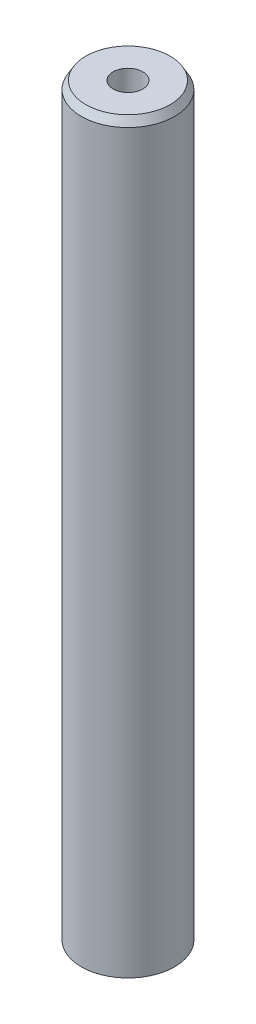
ISO-10303-21;
HEADER;
FILE_DESCRIPTION(('STEP AP214'),'2;1');
FILE_NAME('part.step','',(''),(''),'','','');
FILE_SCHEMA(('AUTOMOTIVE_DESIGN { 1 0 10303 214 1 1 1 1 }'));
ENDSEC;
DATA;
#1=APPLICATION_CONTEXT('core data for automotive mechanical design processes');
#2=APPLICATION_PROTOCOL_DEFINITION('international standard','automotive_design',2000,#1);
#3=PRODUCT_CONTEXT('',#1,'mechanical');
#4=PRODUCT('Part','Part','',(#3));
#5=PRODUCT_RELATED_PRODUCT_CATEGORY('part','',(#4));
#6=PRODUCT_DEFINITION_FORMATION('','',#4);
#7=PRODUCT_DEFINITION_CONTEXT('part definition',#1,'design');
#8=PRODUCT_DEFINITION('design','',#6,#7);
#9=PRODUCT_DEFINITION_SHAPE('','',#8);
#10=(LENGTH_UNIT() NAMED_UNIT(*) SI_UNIT(.MILLI.,.METRE.));
#11=(NAMED_UNIT(*) PLANE_ANGLE_UNIT() SI_UNIT($,.RADIAN.));
#12=(NAMED_UNIT(*) SI_UNIT($,.STERADIAN.) SOLID_ANGLE_UNIT());
#13=UNCERTAINTY_MEASURE_WITH_UNIT(LENGTH_MEASURE(1.E-05),#10,'distance_accuracy_value','');
#14=(GEOMETRIC_REPRESENTATION_CONTEXT(3) GLOBAL_UNCERTAINTY_ASSIGNED_CONTEXT((#13)) GLOBAL_UNIT_ASSIGNED_CONTEXT((#10,
#11,#12)) REPRESENTATION_CONTEXT('',''));
#15=CARTESIAN_POINT('',(0.,0.,0.));
#16=DIRECTION('',(0.,0.,1.));
#17=DIRECTION('',(1.,0.,0.));
#18=AXIS2_PLACEMENT_3D('',#15,#16,#17);
#19=CARTESIAN_POINT('',(0.,361.10832903141,0.));
#20=DIRECTION('',(0.,-1.,0.));
#21=DIRECTION('',(0.,0.,-1.));
#22=AXIS2_PLACEMENT_3D('',#19,#20,#21);
#23=CYLINDRICAL_SURFACE('',#22,22.5);
#24=CARTESIAN_POINT('',(0.,357.303897868596,0.));
#25=DIRECTION('',(0.,1.,0.));
#26=DIRECTION('',(0.,0.,1.));
#27=AXIS2_PLACEMENT_3D('',#24,#25,#26);
#28=CIRCLE('',#27,22.5);
#29=CARTESIAN_POINT('',(0.,357.303897868596,22.5));
#30=VERTEX_POINT('',#29);
#31=EDGE_CURVE('E50',#30,#30,#28,.F.);
#32=ORIENTED_EDGE('',*,*,#31,.T.);
#33=EDGE_LOOP('',(#32));
#34=FACE_BOUND('',#33,.T.);
#35=CARTESIAN_POINT('',(0.,2.196489355964,0.));
#36=DIRECTION('',(0.,1.,0.));
#37=DIRECTION('',(0.,0.,1.));
#38=AXIS2_PLACEMENT_3D('',#35,#36,#37);
#39=CIRCLE('',#38,22.5);
#40=CARTESIAN_POINT('',(0.,2.196489355964,22.5));
#41=VERTEX_POINT('',#40);
#42=EDGE_CURVE('E51',#41,#41,#39,.T.);
#43=ORIENTED_EDGE('',*,*,#42,.T.);
#44=EDGE_LOOP('',(#43));
#45=FACE_BOUND('',#44,.T.);
#46=ADVANCED_FACE('F39',(#34,#45),#23,.T.);
#47=CARTESIAN_POINT('',(0.,361.10832903141,0.));
#48=DIRECTION('',(0.,1.,0.));
#49=DIRECTION('',(0.,0.,1.));
#50=AXIS2_PLACEMENT_3D('',#47,#48,#49);
#51=PLANE('',#50);
#52=CARTESIAN_POINT('',(0.,361.10832903141,0.));
#53=DIRECTION('',(0.,1.,0.));
#54=DIRECTION('',(0.,0.,1.));
#55=AXIS2_PLACEMENT_3D('',#52,#53,#54);
#56=CIRCLE('',#55,20.3035106440359);
#57=CARTESIAN_POINT('',(0.,361.10832903141,20.3035106440359));
#58=VERTEX_POINT('',#57);
#59=EDGE_CURVE('E54',#58,#58,#56,.T.);
#60=ORIENTED_EDGE('',*,*,#59,.T.);
#61=EDGE_LOOP('',(#60));
#62=FACE_BOUND('',#61,.T.);
#63=CARTESIAN_POINT('',(0.,361.10832903141,0.));
#64=DIRECTION('',(0.,1.,0.));
#65=DIRECTION('',(0.,0.,1.));
#66=AXIS2_PLACEMENT_3D('',#63,#64,#65);
#67=CIRCLE('',#66,7.17202574438892);
#68=CARTESIAN_POINT('',(0.,361.10832903141,7.17202574438892));
#69=VERTEX_POINT('',#68);
#70=EDGE_CURVE('E58',#69,#69,#67,.T.);
#71=ORIENTED_EDGE('',*,*,#70,.F.);
#72=EDGE_LOOP('',(#71));
#73=FACE_BOUND('',#72,.T.);
#74=ADVANCED_FACE('F69',(#62,#73),#51,.T.);
#75=CARTESIAN_POINT('',(0.,0.,0.));
#76=DIRECTION('',(0.,1.,0.));
#77=DIRECTION('',(0.,0.,1.));
#78=AXIS2_PLACEMENT_3D('',#75,#76,#77);
#79=PLANE('',#78);
#80=CARTESIAN_POINT('',(0.,0.,0.));
#81=DIRECTION('',(0.,1.,0.));
#82=DIRECTION('',(0.,0.,1.));
#83=AXIS2_PLACEMENT_3D('',#80,#81,#82);
#84=CIRCLE('',#83,18.6955688371861);
#85=CARTESIAN_POINT('',(0.,0.,18.6955688371861));
#86=VERTEX_POINT('',#85);
#87=EDGE_CURVE('E10',#86,#86,#84,.F.);
#88=ORIENTED_EDGE('',*,*,#87,.T.);
#89=EDGE_LOOP('',(#88));
#90=FACE_BOUND('',#89,.T.);
#91=CARTESIAN_POINT('',(0.,0.,0.));
#92=DIRECTION('',(0.,1.,0.));
#93=DIRECTION('',(0.,0.,1.));
#94=AXIS2_PLACEMENT_3D('',#91,#92,#93);
#95=CIRCLE('',#94,7.17202574438892);
#96=CARTESIAN_POINT('',(0.,0.,7.17202574438892));
#97=VERTEX_POINT('',#96);
#98=EDGE_CURVE('E63',#97,#97,#95,.T.);
#99=ORIENTED_EDGE('',*,*,#98,.T.);
#100=EDGE_LOOP('',(#99));
#101=FACE_BOUND('',#100,.T.);
#102=ADVANCED_FACE('F75',(#90,#101),#79,.F.);
#103=CARTESIAN_POINT('',(0.,361.10832903141,0.));
#104=DIRECTION('',(0.,-1.,0.));
#105=DIRECTION('',(0.,0.,-1.));
#106=AXIS2_PLACEMENT_3D('',#103,#104,#105);
#107=CYLINDRICAL_SURFACE('',#106,7.17202574438892);
#108=ORIENTED_EDGE('',*,*,#70,.T.);
#109=EDGE_LOOP('',(#108));
#110=FACE_BOUND('',#109,.T.);
#111=ORIENTED_EDGE('',*,*,#98,.F.);
#112=EDGE_LOOP('',(#111));
#113=FACE_BOUND('',#112,.T.);
#114=ADVANCED_FACE('F70',(#110,#113),#107,.F.);
#115=CARTESIAN_POINT('',(0.,361.10832903141,0.));
#116=DIRECTION('',(0.,-1.,0.));
#117=DIRECTION('',(0.,0.,-1.));
#118=AXIS2_PLACEMENT_3D('',#115,#116,#117);
#119=CONICAL_SURFACE('',#118,20.3035106440359,0.523598775598296);
#120=ORIENTED_EDGE('',*,*,#31,.F.);
#121=EDGE_LOOP('',(#120));
#122=FACE_BOUND('',#121,.T.);
#123=ORIENTED_EDGE('',*,*,#59,.F.);
#124=EDGE_LOOP('',(#123));
#125=FACE_BOUND('',#124,.T.);
#126=ADVANCED_FACE('F81',(#122,#125),#119,.T.);
#127=CARTESIAN_POINT('',(0.,2.196489355964,0.));
#128=DIRECTION('',(0.,1.,0.));
#129=DIRECTION('',(0.,0.,1.));
#130=AXIS2_PLACEMENT_3D('',#127,#128,#129);
#131=CONICAL_SURFACE('',#130,22.5,1.0471975511966);
#132=ORIENTED_EDGE('',*,*,#87,.F.);
#133=EDGE_LOOP('',(#132));
#134=FACE_BOUND('',#133,.T.);
#135=ORIENTED_EDGE('',*,*,#42,.F.);
#136=EDGE_LOOP('',(#135));
#137=FACE_BOUND('',#136,.T.);
#138=ADVANCED_FACE('F45',(#134,#137),#131,.T.);
#139=CLOSED_SHELL('',(#46,#74,#102,#114,#126,#138));
#140=MANIFOLD_SOLID_BREP('B2',#139);
#141=ADVANCED_BREP_SHAPE_REPRESENTATION('',(#18,#140),#14);
#142=SHAPE_DEFINITION_REPRESENTATION(#9,#141);
ENDSEC;
END-ISO-10303-21;
